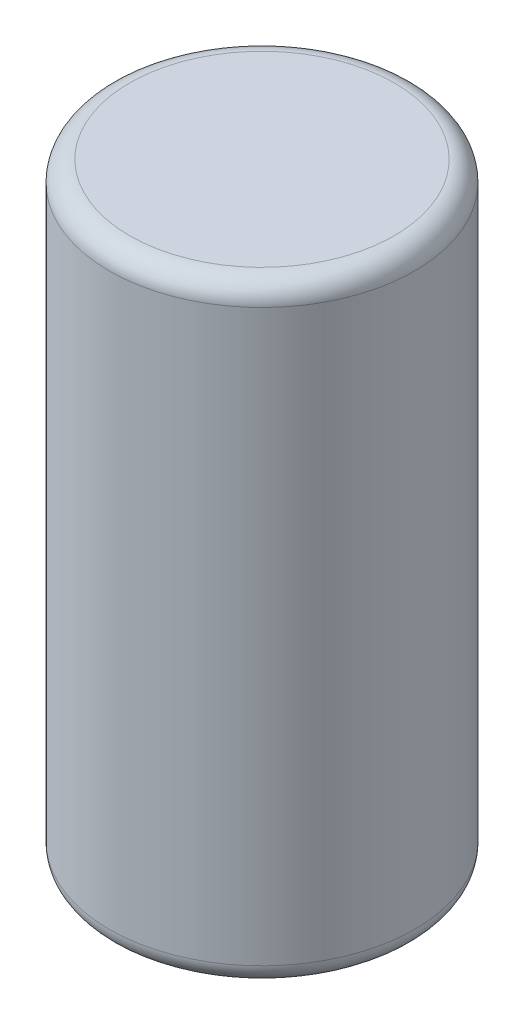
ISO-10303-21;
HEADER;
FILE_DESCRIPTION(('STEP AP214'),'2;1');
FILE_NAME('part.step','',(''),(''),'','','');
FILE_SCHEMA(('AUTOMOTIVE_DESIGN { 1 0 10303 214 1 1 1 1 }'));
ENDSEC;
DATA;
#1=APPLICATION_CONTEXT('core data for automotive mechanical design processes');
#2=APPLICATION_PROTOCOL_DEFINITION('international standard','automotive_design',2000,#1);
#3=PRODUCT_CONTEXT('',#1,'mechanical');
#4=PRODUCT('Part','Part','',(#3));
#5=PRODUCT_RELATED_PRODUCT_CATEGORY('part','',(#4));
#6=PRODUCT_DEFINITION_FORMATION('','',#4);
#7=PRODUCT_DEFINITION_CONTEXT('part definition',#1,'design');
#8=PRODUCT_DEFINITION('design','',#6,#7);
#9=PRODUCT_DEFINITION_SHAPE('','',#8);
#10=(LENGTH_UNIT() NAMED_UNIT(*) SI_UNIT(.MILLI.,.METRE.));
#11=(NAMED_UNIT(*) PLANE_ANGLE_UNIT() SI_UNIT($,.RADIAN.));
#12=(NAMED_UNIT(*) SI_UNIT($,.STERADIAN.) SOLID_ANGLE_UNIT());
#13=UNCERTAINTY_MEASURE_WITH_UNIT(LENGTH_MEASURE(1.E-05),#10,'distance_accuracy_value','');
#14=(GEOMETRIC_REPRESENTATION_CONTEXT(3) GLOBAL_UNCERTAINTY_ASSIGNED_CONTEXT((#13)) GLOBAL_UNIT_ASSIGNED_CONTEXT((#10,
#11,#12)) REPRESENTATION_CONTEXT('',''));
#15=CARTESIAN_POINT('',(0.,0.,0.));
#16=DIRECTION('',(0.,0.,1.));
#17=DIRECTION('',(1.,0.,0.));
#18=AXIS2_PLACEMENT_3D('',#15,#16,#17);
#19=CARTESIAN_POINT('',(0.,6.,0.));
#20=DIRECTION('',(0.,-1.,0.));
#21=DIRECTION('',(0.,0.,-1.));
#22=AXIS2_PLACEMENT_3D('',#19,#20,#21);
#23=CYLINDRICAL_SURFACE('',#22,1.5);
#24=CARTESIAN_POINT('',(0.,0.2,0.));
#25=DIRECTION('',(0.,1.,0.));
#26=DIRECTION('',(0.,0.,1.));
#27=AXIS2_PLACEMENT_3D('',#24,#25,#26);
#28=CIRCLE('',#27,1.5);
#29=CARTESIAN_POINT('',(0.,0.2,1.5));
#30=VERTEX_POINT('',#29);
#31=EDGE_CURVE('E42',#30,#30,#28,.T.);
#32=ORIENTED_EDGE('',*,*,#31,.T.);
#33=EDGE_LOOP('',(#32));
#34=FACE_BOUND('',#33,.T.);
#35=CARTESIAN_POINT('',(0.,5.8,0.));
#36=DIRECTION('',(0.,1.,0.));
#37=DIRECTION('',(0.,0.,1.));
#38=AXIS2_PLACEMENT_3D('',#35,#36,#37);
#39=CIRCLE('',#38,1.5);
#40=CARTESIAN_POINT('',(0.,5.8,1.5));
#41=VERTEX_POINT('',#40);
#42=EDGE_CURVE('E46',#41,#41,#39,.F.);
#43=ORIENTED_EDGE('',*,*,#42,.T.);
#44=EDGE_LOOP('',(#43));
#45=FACE_BOUND('',#44,.T.);
#46=ADVANCED_FACE('F31',(#34,#45),#23,.T.);
#47=CARTESIAN_POINT('',(0.,6.,0.));
#48=DIRECTION('',(0.,1.,0.));
#49=DIRECTION('',(0.,0.,1.));
#50=AXIS2_PLACEMENT_3D('',#47,#48,#49);
#51=PLANE('',#50);
#52=CARTESIAN_POINT('',(0.,6.,0.));
#53=DIRECTION('',(0.,1.,0.));
#54=DIRECTION('',(0.,0.,1.));
#55=AXIS2_PLACEMENT_3D('',#52,#53,#54);
#56=CIRCLE('',#55,1.3);
#57=CARTESIAN_POINT('',(0.,6.,1.3));
#58=VERTEX_POINT('',#57);
#59=EDGE_CURVE('E10',#58,#58,#56,.T.);
#60=ORIENTED_EDGE('',*,*,#59,.T.);
#61=EDGE_LOOP('',(#60));
#62=FACE_BOUND('',#61,.T.);
#63=ADVANCED_FACE('F62',(#62),#51,.T.);
#64=CARTESIAN_POINT('',(0.,0.,0.));
#65=DIRECTION('',(0.,1.,0.));
#66=DIRECTION('',(0.,0.,1.));
#67=AXIS2_PLACEMENT_3D('',#64,#65,#66);
#68=PLANE('',#67);
#69=CARTESIAN_POINT('',(0.,0.,0.));
#70=DIRECTION('',(0.,1.,0.));
#71=DIRECTION('',(0.,0.,1.));
#72=AXIS2_PLACEMENT_3D('',#69,#70,#71);
#73=CIRCLE('',#72,1.3);
#74=CARTESIAN_POINT('',(0.,0.,1.3));
#75=VERTEX_POINT('',#74);
#76=EDGE_CURVE('E38',#75,#75,#73,.F.);
#77=ORIENTED_EDGE('',*,*,#76,.T.);
#78=EDGE_LOOP('',(#77));
#79=FACE_BOUND('',#78,.T.);
#80=ADVANCED_FACE('F59',(#79),#68,.F.);
#81=CARTESIAN_POINT('',(0.,0.2,0.));
#82=DIRECTION('',(0.,1.,0.));
#83=DIRECTION('',(0.,0.,1.));
#84=AXIS2_PLACEMENT_3D('',#81,#82,#83);
#85=TOROIDAL_SURFACE('',#84,1.3,0.2);
#86=ORIENTED_EDGE('',*,*,#76,.F.);
#87=EDGE_LOOP('',(#86));
#88=FACE_BOUND('',#87,.T.);
#89=ORIENTED_EDGE('',*,*,#31,.F.);
#90=EDGE_LOOP('',(#89));
#91=FACE_BOUND('',#90,.T.);
#92=ADVANCED_FACE('F55',(#88,#91),#85,.T.);
#93=CARTESIAN_POINT('',(0.,5.8,0.));
#94=DIRECTION('',(0.,1.,0.));
#95=DIRECTION('',(0.,0.,1.));
#96=AXIS2_PLACEMENT_3D('',#93,#94,#95);
#97=TOROIDAL_SURFACE('',#96,1.3,0.2);
#98=ORIENTED_EDGE('',*,*,#42,.F.);
#99=EDGE_LOOP('',(#98));
#100=FACE_BOUND('',#99,.T.);
#101=ORIENTED_EDGE('',*,*,#59,.F.);
#102=EDGE_LOOP('',(#101));
#103=FACE_BOUND('',#102,.T.);
#104=ADVANCED_FACE('F33',(#100,#103),#97,.T.);
#105=CLOSED_SHELL('',(#46,#63,#80,#92,#104));
#106=MANIFOLD_SOLID_BREP('B2',#105);
#107=ADVANCED_BREP_SHAPE_REPRESENTATION('',(#18,#106),#14);
#108=SHAPE_DEFINITION_REPRESENTATION(#9,#107);
ENDSEC;
END-ISO-10303-21;
